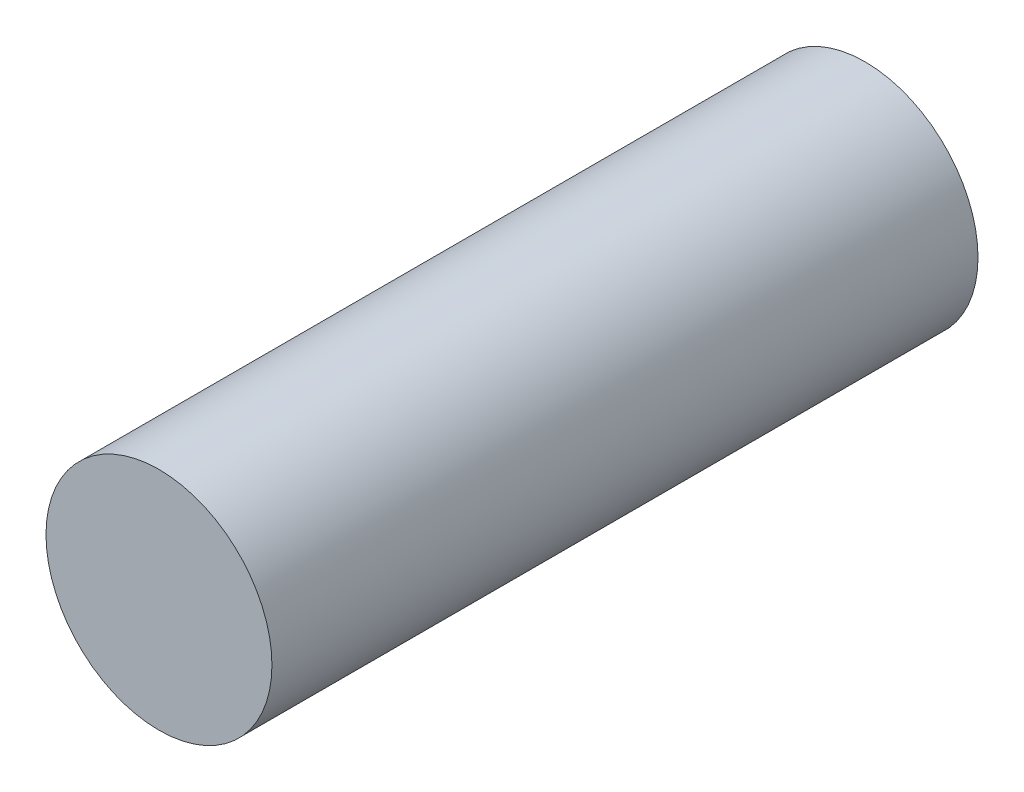
ISO-10303-21;
HEADER;
FILE_DESCRIPTION(('STEP AP214'),'2;1');
FILE_NAME('part.step','',(''),(''),'','','');
FILE_SCHEMA(('AUTOMOTIVE_DESIGN { 1 0 10303 214 1 1 1 1 }'));
ENDSEC;
DATA;
#1=APPLICATION_CONTEXT('core data for automotive mechanical design processes');
#2=APPLICATION_PROTOCOL_DEFINITION('international standard','automotive_design',2000,#1);
#3=PRODUCT_CONTEXT('',#1,'mechanical');
#4=PRODUCT('Part','Part','',(#3));
#5=PRODUCT_RELATED_PRODUCT_CATEGORY('part','',(#4));
#6=PRODUCT_DEFINITION_FORMATION('','',#4);
#7=PRODUCT_DEFINITION_CONTEXT('part definition',#1,'design');
#8=PRODUCT_DEFINITION('design','',#6,#7);
#9=PRODUCT_DEFINITION_SHAPE('','',#8);
#10=(LENGTH_UNIT() NAMED_UNIT(*) SI_UNIT(.MILLI.,.METRE.));
#11=(NAMED_UNIT(*) PLANE_ANGLE_UNIT() SI_UNIT($,.RADIAN.));
#12=(NAMED_UNIT(*) SI_UNIT($,.STERADIAN.) SOLID_ANGLE_UNIT());
#13=UNCERTAINTY_MEASURE_WITH_UNIT(LENGTH_MEASURE(1.E-05),#10,'distance_accuracy_value','');
#14=(GEOMETRIC_REPRESENTATION_CONTEXT(3) GLOBAL_UNCERTAINTY_ASSIGNED_CONTEXT((#13)) GLOBAL_UNIT_ASSIGNED_CONTEXT((#10,
#11,#12)) REPRESENTATION_CONTEXT('',''));
#15=CARTESIAN_POINT('',(0.,0.,0.));
#16=DIRECTION('',(0.,0.,1.));
#17=DIRECTION('',(1.,0.,0.));
#18=AXIS2_PLACEMENT_3D('',#15,#16,#17);
#19=CARTESIAN_POINT('',(0.,0.,50.));
#20=DIRECTION('',(0.,0.,-1.));
#21=DIRECTION('',(-1.,0.,0.));
#22=AXIS2_PLACEMENT_3D('',#19,#20,#21);
#23=CYLINDRICAL_SURFACE('',#22,8.);
#24=CARTESIAN_POINT('',(0.,0.,50.));
#25=DIRECTION('',(0.,0.,1.));
#26=DIRECTION('',(1.,0.,0.));
#27=AXIS2_PLACEMENT_3D('',#24,#25,#26);
#28=CIRCLE('',#27,8.);
#29=CARTESIAN_POINT('',(8.,0.,50.));
#30=VERTEX_POINT('',#29);
#31=EDGE_CURVE('E10',#30,#30,#28,.T.);
#32=ORIENTED_EDGE('',*,*,#31,.F.);
#33=EDGE_LOOP('',(#32));
#34=FACE_BOUND('',#33,.T.);
#35=CARTESIAN_POINT('',(0.,0.,0.));
#36=DIRECTION('',(0.,0.,1.));
#37=DIRECTION('',(1.,0.,0.));
#38=AXIS2_PLACEMENT_3D('',#35,#36,#37);
#39=CIRCLE('',#38,8.);
#40=CARTESIAN_POINT('',(8.,0.,0.));
#41=VERTEX_POINT('',#40);
#42=EDGE_CURVE('E32',#41,#41,#39,.T.);
#43=ORIENTED_EDGE('',*,*,#42,.T.);
#44=EDGE_LOOP('',(#43));
#45=FACE_BOUND('',#44,.T.);
#46=ADVANCED_FACE('F29',(#34,#45),#23,.T.);
#47=CARTESIAN_POINT('',(0.,0.,50.));
#48=DIRECTION('',(0.,0.,1.));
#49=DIRECTION('',(1.,0.,0.));
#50=AXIS2_PLACEMENT_3D('',#47,#48,#49);
#51=PLANE('',#50);
#52=ORIENTED_EDGE('',*,*,#31,.T.);
#53=EDGE_LOOP('',(#52));
#54=FACE_BOUND('',#53,.T.);
#55=ADVANCED_FACE('F44',(#54),#51,.T.);
#56=CARTESIAN_POINT('',(0.,0.,0.));
#57=DIRECTION('',(0.,0.,1.));
#58=DIRECTION('',(1.,0.,0.));
#59=AXIS2_PLACEMENT_3D('',#56,#57,#58);
#60=PLANE('',#59);
#61=ORIENTED_EDGE('',*,*,#42,.F.);
#62=EDGE_LOOP('',(#61));
#63=FACE_BOUND('',#62,.T.);
#64=ADVANCED_FACE('F42',(#63),#60,.F.);
#65=CLOSED_SHELL('',(#46,#55,#64));
#66=MANIFOLD_SOLID_BREP('B2',#65);
#67=ADVANCED_BREP_SHAPE_REPRESENTATION('',(#18,#66),#14);
#68=SHAPE_DEFINITION_REPRESENTATION(#9,#67);
ENDSEC;
END-ISO-10303-21;
